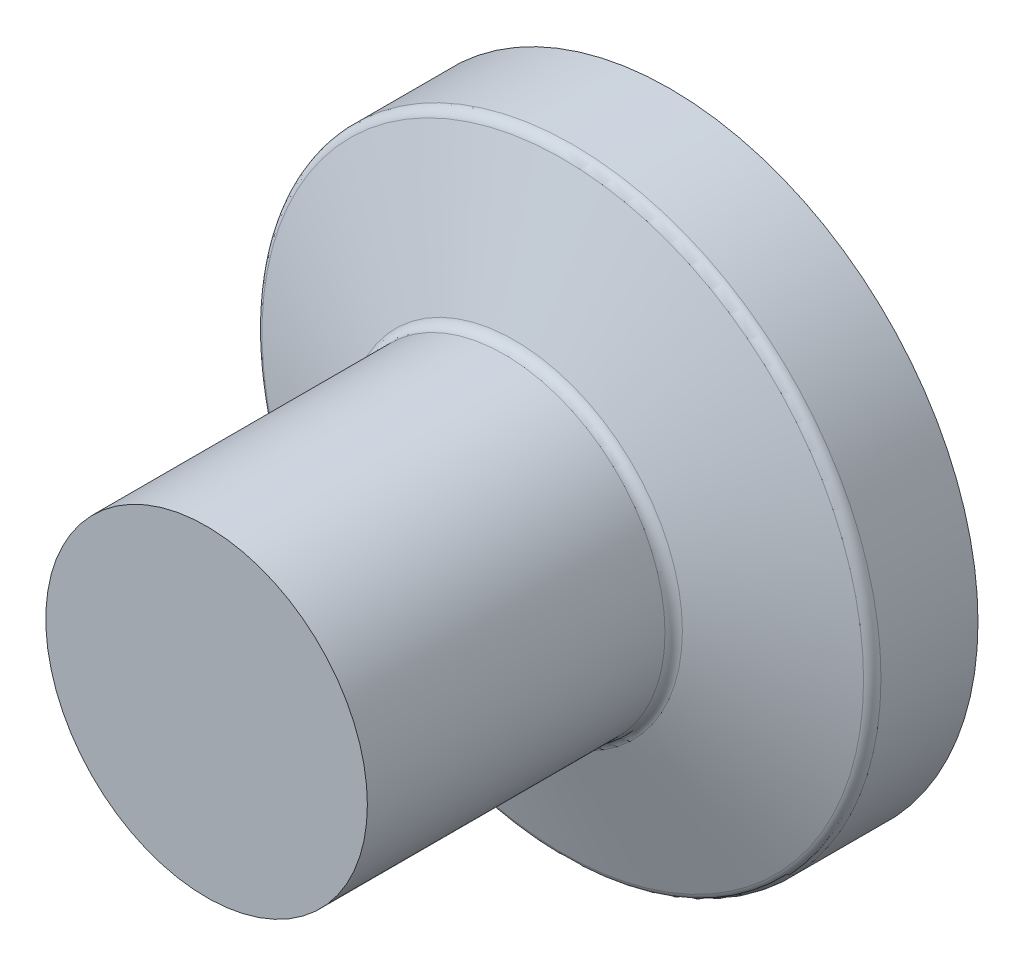
ISO-10303-21;
HEADER;
FILE_DESCRIPTION(('STEP AP214'),'2;1');
FILE_NAME('part.step','',(''),(''),'','','');
FILE_SCHEMA(('AUTOMOTIVE_DESIGN { 1 0 10303 214 1 1 1 1 }'));
ENDSEC;
DATA;
#1=APPLICATION_CONTEXT('core data for automotive mechanical design processes');
#2=APPLICATION_PROTOCOL_DEFINITION('international standard','automotive_design',2000,#1);
#3=PRODUCT_CONTEXT('',#1,'mechanical');
#4=PRODUCT('Part','Part','',(#3));
#5=PRODUCT_RELATED_PRODUCT_CATEGORY('part','',(#4));
#6=PRODUCT_DEFINITION_FORMATION('','',#4);
#7=PRODUCT_DEFINITION_CONTEXT('part definition',#1,'design');
#8=PRODUCT_DEFINITION('design','',#6,#7);
#9=PRODUCT_DEFINITION_SHAPE('','',#8);
#10=(LENGTH_UNIT() NAMED_UNIT(*) SI_UNIT(.MILLI.,.METRE.));
#11=(NAMED_UNIT(*) PLANE_ANGLE_UNIT() SI_UNIT($,.RADIAN.));
#12=(NAMED_UNIT(*) SI_UNIT($,.STERADIAN.) SOLID_ANGLE_UNIT());
#13=UNCERTAINTY_MEASURE_WITH_UNIT(LENGTH_MEASURE(1.E-05),#10,'distance_accuracy_value','');
#14=(GEOMETRIC_REPRESENTATION_CONTEXT(3) GLOBAL_UNCERTAINTY_ASSIGNED_CONTEXT((#13)) GLOBAL_UNIT_ASSIGNED_CONTEXT((#10,
#11,#12)) REPRESENTATION_CONTEXT('',''));
#15=CARTESIAN_POINT('',(0.,0.,0.));
#16=DIRECTION('',(0.,0.,1.));
#17=DIRECTION('',(1.,0.,0.));
#18=AXIS2_PLACEMENT_3D('',#15,#16,#17);
#19=CARTESIAN_POINT('',(0.,0.,0.));
#20=DIRECTION('',(0.,0.,-1.));
#21=DIRECTION('',(-1.,0.,0.));
#22=AXIS2_PLACEMENT_3D('',#19,#20,#21);
#23=PLANE('',#22);
#24=CARTESIAN_POINT('',(0.,0.,0.));
#25=DIRECTION('',(0.,0.,1.));
#26=DIRECTION('',(1.,0.,0.));
#27=AXIS2_PLACEMENT_3D('',#24,#25,#26);
#28=CIRCLE('',#27,14.75);
#29=CARTESIAN_POINT('',(14.75,0.,0.));
#30=VERTEX_POINT('',#29);
#31=EDGE_CURVE('E12',#30,#30,#28,.T.);
#32=ORIENTED_EDGE('',*,*,#31,.T.);
#33=EDGE_LOOP('',(#32));
#34=FACE_BOUND('',#33,.T.);
#35=ADVANCED_FACE('F44',(#34),#23,.F.);
#36=CARTESIAN_POINT('',(0.,0.,0.));
#37=DIRECTION('',(0.,0.,1.));
#38=DIRECTION('',(1.,0.,0.));
#39=AXIS2_PLACEMENT_3D('',#36,#37,#38);
#40=CYLINDRICAL_SURFACE('',#39,14.75);
#41=ORIENTED_EDGE('',*,*,#31,.F.);
#42=EDGE_LOOP('',(#41));
#43=FACE_BOUND('',#42,.T.);
#44=CARTESIAN_POINT('',(0.,0.,-27.2997924617903));
#45=DIRECTION('',(0.,0.,1.));
#46=DIRECTION('',(1.,0.,0.));
#47=AXIS2_PLACEMENT_3D('',#44,#45,#46);
#48=CIRCLE('',#47,14.75);
#49=CARTESIAN_POINT('',(14.75,0.,-27.2997924617903));
#50=VERTEX_POINT('',#49);
#51=EDGE_CURVE('E50',#50,#50,#48,.T.);
#52=ORIENTED_EDGE('',*,*,#51,.T.);
#53=EDGE_LOOP('',(#52));
#54=FACE_BOUND('',#53,.T.);
#55=ADVANCED_FACE('F85',(#43,#54),#40,.T.);
#56=CARTESIAN_POINT('',(0.,0.,-27.2997924617903));
#57=DIRECTION('',(0.,0.,1.));
#58=DIRECTION('',(1.,0.,0.));
#59=AXIS2_PLACEMENT_3D('',#56,#57,#58);
#60=TOROIDAL_SURFACE('',#59,15.75,1.);
#61=ORIENTED_EDGE('',*,*,#51,.F.);
#62=EDGE_LOOP('',(#61));
#63=FACE_BOUND('',#62,.T.);
#64=CARTESIAN_POINT('',(0.,0.,-28.2394850825762));
#65=DIRECTION('',(0.,0.,1.));
#66=DIRECTION('',(1.,0.,0.));
#67=AXIS2_PLACEMENT_3D('',#64,#65,#66);
#68=CIRCLE('',#67,15.4079798566743);
#69=CARTESIAN_POINT('',(15.4079798566743,0.,-28.2394850825762));
#70=VERTEX_POINT('',#69);
#71=EDGE_CURVE('E54',#70,#70,#68,.T.);
#72=ORIENTED_EDGE('',*,*,#71,.T.);
#73=EDGE_LOOP('',(#72));
#74=FACE_BOUND('',#73,.T.);
#75=ADVANCED_FACE('F89',(#63,#74),#60,.F.);
#76=CARTESIAN_POINT('',(0.,0.,-32.6741130800175));
#77=DIRECTION('',(0.,0.,-1.));
#78=DIRECTION('',(-1.,0.,0.));
#79=AXIS2_PLACEMENT_3D('',#76,#77,#78);
#80=CONICAL_SURFACE('',#79,27.5920201433257,1.22173047639603);
#81=ORIENTED_EDGE('',*,*,#71,.F.);
#82=EDGE_LOOP('',(#81));
#83=FACE_BOUND('',#82,.T.);
#84=CARTESIAN_POINT('',(0.,0.,-32.6741130800175));
#85=DIRECTION('',(0.,0.,1.));
#86=DIRECTION('',(1.,0.,0.));
#87=AXIS2_PLACEMENT_3D('',#84,#85,#86);
#88=CIRCLE('',#87,27.5920201433257);
#89=CARTESIAN_POINT('',(27.5920201433257,0.,-32.6741130800175));
#90=VERTEX_POINT('',#89);
#91=EDGE_CURVE('E58',#90,#90,#88,.T.);
#92=ORIENTED_EDGE('',*,*,#91,.T.);
#93=EDGE_LOOP('',(#92));
#94=FACE_BOUND('',#93,.T.);
#95=ADVANCED_FACE('F94',(#83,#94),#80,.T.);
#96=CARTESIAN_POINT('',(0.,0.,-33.6138057008034));
#97=DIRECTION('',(0.,0.,1.));
#98=DIRECTION('',(1.,0.,0.));
#99=AXIS2_PLACEMENT_3D('',#96,#97,#98);
#100=TOROIDAL_SURFACE('',#99,27.25,1.);
#101=ORIENTED_EDGE('',*,*,#91,.F.);
#102=EDGE_LOOP('',(#101));
#103=FACE_BOUND('',#102,.T.);
#104=CARTESIAN_POINT('',(0.,0.,-33.6138057008034));
#105=DIRECTION('',(0.,0.,1.));
#106=DIRECTION('',(1.,0.,0.));
#107=AXIS2_PLACEMENT_3D('',#104,#105,#106);
#108=CIRCLE('',#107,28.25);
#109=CARTESIAN_POINT('',(28.25,0.,-33.6138057008034));
#110=VERTEX_POINT('',#109);
#111=EDGE_CURVE('E63',#110,#110,#108,.T.);
#112=ORIENTED_EDGE('',*,*,#111,.T.);
#113=EDGE_LOOP('',(#112));
#114=FACE_BOUND('',#113,.T.);
#115=ADVANCED_FACE('F100',(#103,#114),#100,.T.);
#116=CARTESIAN_POINT('',(0.,0.,0.));
#117=DIRECTION('',(0.,0.,1.));
#118=DIRECTION('',(1.,0.,0.));
#119=AXIS2_PLACEMENT_3D('',#116,#117,#118);
#120=CYLINDRICAL_SURFACE('',#119,28.25);
#121=ORIENTED_EDGE('',*,*,#111,.F.);
#122=EDGE_LOOP('',(#121));
#123=FACE_BOUND('',#122,.T.);
#124=CARTESIAN_POINT('',(0.,0.,-42.5135981625937));
#125=DIRECTION('',(0.,0.,1.));
#126=DIRECTION('',(1.,0.,0.));
#127=AXIS2_PLACEMENT_3D('',#124,#125,#126);
#128=CIRCLE('',#127,28.25);
#129=CARTESIAN_POINT('',(28.25,0.,-42.5135981625937));
#130=VERTEX_POINT('',#129);
#131=EDGE_CURVE('E66',#130,#130,#128,.T.);
#132=ORIENTED_EDGE('',*,*,#131,.T.);
#133=EDGE_LOOP('',(#132));
#134=FACE_BOUND('',#133,.T.);
#135=ADVANCED_FACE('F81',(#123,#134),#120,.T.);
#136=CARTESIAN_POINT('',(0.,28.25,-42.5135981625937));
#137=DIRECTION('',(0.,0.,1.));
#138=DIRECTION('',(1.,0.,0.));
#139=AXIS2_PLACEMENT_3D('',#136,#137,#138);
#140=PLANE('',#139);
#141=ORIENTED_EDGE('',*,*,#131,.F.);
#142=EDGE_LOOP('',(#141));
#143=FACE_BOUND('',#142,.T.);
#144=CARTESIAN_POINT('',(0.,0.,-42.5135981625937));
#145=DIRECTION('',(0.,0.,1.));
#146=DIRECTION('',(1.,0.,0.));
#147=AXIS2_PLACEMENT_3D('',#144,#145,#146);
#148=CIRCLE('',#147,24.25);
#149=CARTESIAN_POINT('',(24.25,0.,-42.5135981625937));
#150=VERTEX_POINT('',#149);
#151=EDGE_CURVE('E69',#150,#150,#148,.T.);
#152=ORIENTED_EDGE('',*,*,#151,.T.);
#153=EDGE_LOOP('',(#152));
#154=FACE_BOUND('',#153,.T.);
#155=ADVANCED_FACE('F73',(#143,#154),#140,.F.);
#156=CARTESIAN_POINT('',(0.,0.,-16.2617753579089));
#157=DIRECTION('',(0.,0.,1.));
#158=DIRECTION('',(0.,1.,0.));
#159=AXIS2_PLACEMENT_3D('',#156,#157,#158);
#160=SPHERICAL_SURFACE('',#159,35.7382246420911);
#161=ORIENTED_EDGE('',*,*,#151,.F.);
#162=EDGE_LOOP('',(#161));
#163=FACE_BOUND('',#162,.T.);
#164=ADVANCED_FACE('F75',(#163),#160,.T.);
#165=CLOSED_SHELL('',(#35,#55,#75,#95,#115,#135,#155,#164));
#166=MANIFOLD_SOLID_BREP('B2',#165);
#167=ADVANCED_BREP_SHAPE_REPRESENTATION('',(#18,#166),#14);
#168=SHAPE_DEFINITION_REPRESENTATION(#9,#167);
ENDSEC;
END-ISO-10303-21;
